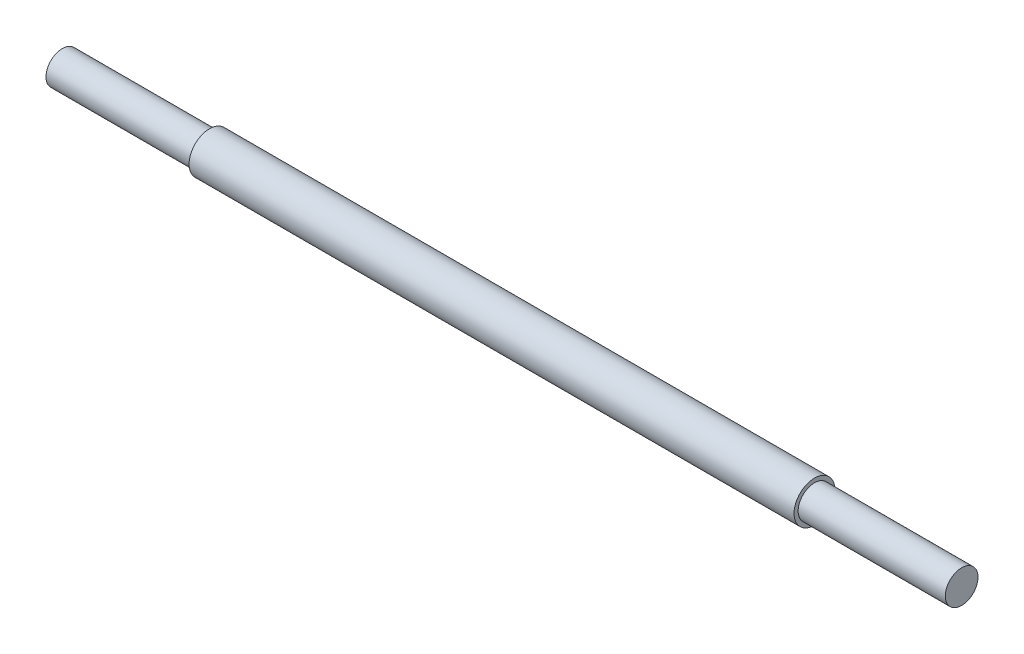
ISO-10303-21;
HEADER;
FILE_DESCRIPTION(('STEP AP214'),'2;1');
FILE_NAME('part.step','',(''),(''),'','','');
FILE_SCHEMA(('AUTOMOTIVE_DESIGN { 1 0 10303 214 1 1 1 1 }'));
ENDSEC;
DATA;
#1=APPLICATION_CONTEXT('core data for automotive mechanical design processes');
#2=APPLICATION_PROTOCOL_DEFINITION('international standard','automotive_design',2000,#1);
#3=PRODUCT_CONTEXT('',#1,'mechanical');
#4=PRODUCT('Part','Part','',(#3));
#5=PRODUCT_RELATED_PRODUCT_CATEGORY('part','',(#4));
#6=PRODUCT_DEFINITION_FORMATION('','',#4);
#7=PRODUCT_DEFINITION_CONTEXT('part definition',#1,'design');
#8=PRODUCT_DEFINITION('design','',#6,#7);
#9=PRODUCT_DEFINITION_SHAPE('','',#8);
#10=(LENGTH_UNIT() NAMED_UNIT(*) SI_UNIT(.MILLI.,.METRE.));
#11=(NAMED_UNIT(*) PLANE_ANGLE_UNIT() SI_UNIT($,.RADIAN.));
#12=(NAMED_UNIT(*) SI_UNIT($,.STERADIAN.) SOLID_ANGLE_UNIT());
#13=UNCERTAINTY_MEASURE_WITH_UNIT(LENGTH_MEASURE(1.E-05),#10,'distance_accuracy_value','');
#14=(GEOMETRIC_REPRESENTATION_CONTEXT(3) GLOBAL_UNCERTAINTY_ASSIGNED_CONTEXT((#13)) GLOBAL_UNIT_ASSIGNED_CONTEXT((#10,
#11,#12)) REPRESENTATION_CONTEXT('',''));
#15=CARTESIAN_POINT('',(0.,0.,0.));
#16=DIRECTION('',(0.,0.,1.));
#17=DIRECTION('',(1.,0.,0.));
#18=AXIS2_PLACEMENT_3D('',#15,#16,#17);
#19=CARTESIAN_POINT('',(45.,0.,0.));
#20=DIRECTION('',(-1.,0.,0.));
#21=DIRECTION('',(0.,0.,1.));
#22=AXIS2_PLACEMENT_3D('',#19,#20,#21);
#23=CYLINDRICAL_SURFACE('',#22,2.5);
#24=CARTESIAN_POINT('',(37.,0.,0.));
#25=DIRECTION('',(1.,0.,0.));
#26=DIRECTION('',(0.,0.,-1.));
#27=AXIS2_PLACEMENT_3D('',#24,#25,#26);
#28=CIRCLE('',#27,2.5);
#29=CARTESIAN_POINT('',(37.,0.,-2.5));
#30=VERTEX_POINT('',#29);
#31=EDGE_CURVE('E10',#30,#30,#28,.T.);
#32=ORIENTED_EDGE('',*,*,#31,.F.);
#33=EDGE_LOOP('',(#32));
#34=FACE_BOUND('',#33,.T.);
#35=CARTESIAN_POINT('',(-37.,0.,0.));
#36=DIRECTION('',(-1.,0.,0.));
#37=DIRECTION('',(0.,0.,1.));
#38=AXIS2_PLACEMENT_3D('',#35,#36,#37);
#39=CIRCLE('',#38,2.5);
#40=CARTESIAN_POINT('',(-37.,0.,2.5));
#41=VERTEX_POINT('',#40);
#42=EDGE_CURVE('E51',#41,#41,#39,.T.);
#43=ORIENTED_EDGE('',*,*,#42,.F.);
#44=EDGE_LOOP('',(#43));
#45=FACE_BOUND('',#44,.T.);
#46=ADVANCED_FACE('F41',(#34,#45),#23,.T.);
#47=CARTESIAN_POINT('',(37.,0.,0.));
#48=DIRECTION('',(1.,0.,0.));
#49=DIRECTION('',(0.,0.,-1.));
#50=AXIS2_PLACEMENT_3D('',#47,#48,#49);
#51=PLANE('',#50);
#52=CARTESIAN_POINT('',(37.,0.,0.));
#53=DIRECTION('',(1.,0.,0.));
#54=DIRECTION('',(0.,0.,-1.));
#55=AXIS2_PLACEMENT_3D('',#52,#53,#54);
#56=CIRCLE('',#55,2.);
#57=CARTESIAN_POINT('',(37.,0.,-2.));
#58=VERTEX_POINT('',#57);
#59=EDGE_CURVE('E47',#58,#58,#56,.T.);
#60=ORIENTED_EDGE('',*,*,#59,.F.);
#61=EDGE_LOOP('',(#60));
#62=FACE_BOUND('',#61,.T.);
#63=ORIENTED_EDGE('',*,*,#31,.T.);
#64=EDGE_LOOP('',(#63));
#65=FACE_BOUND('',#64,.T.);
#66=ADVANCED_FACE('F85',(#62,#65),#51,.T.);
#67=CARTESIAN_POINT('',(37.,0.,0.));
#68=DIRECTION('',(1.,0.,0.));
#69=DIRECTION('',(0.,0.,-1.));
#70=AXIS2_PLACEMENT_3D('',#67,#68,#69);
#71=CYLINDRICAL_SURFACE('',#70,2.);
#72=ORIENTED_EDGE('',*,*,#59,.T.);
#73=EDGE_LOOP('',(#72));
#74=FACE_BOUND('',#73,.T.);
#75=CARTESIAN_POINT('',(55.,0.,0.));
#76=DIRECTION('',(1.,0.,0.));
#77=DIRECTION('',(0.,0.,-1.));
#78=AXIS2_PLACEMENT_3D('',#75,#76,#77);
#79=CIRCLE('',#78,2.);
#80=CARTESIAN_POINT('',(55.,0.,-2.));
#81=VERTEX_POINT('',#80);
#82=EDGE_CURVE('E60',#81,#81,#79,.T.);
#83=ORIENTED_EDGE('',*,*,#82,.F.);
#84=EDGE_LOOP('',(#83));
#85=FACE_BOUND('',#84,.T.);
#86=ADVANCED_FACE('F81',(#74,#85),#71,.T.);
#87=CARTESIAN_POINT('',(-37.,0.,0.));
#88=DIRECTION('',(-1.,0.,0.));
#89=DIRECTION('',(0.,0.,1.));
#90=AXIS2_PLACEMENT_3D('',#87,#88,#89);
#91=PLANE('',#90);
#92=CARTESIAN_POINT('',(-37.,0.,0.));
#93=DIRECTION('',(-1.,0.,0.));
#94=DIRECTION('',(0.,0.,1.));
#95=AXIS2_PLACEMENT_3D('',#92,#93,#94);
#96=CIRCLE('',#95,2.);
#97=CARTESIAN_POINT('',(-37.,0.,2.));
#98=VERTEX_POINT('',#97);
#99=EDGE_CURVE('E55',#98,#98,#96,.T.);
#100=ORIENTED_EDGE('',*,*,#99,.F.);
#101=EDGE_LOOP('',(#100));
#102=FACE_BOUND('',#101,.T.);
#103=ORIENTED_EDGE('',*,*,#42,.T.);
#104=EDGE_LOOP('',(#103));
#105=FACE_BOUND('',#104,.T.);
#106=ADVANCED_FACE('F72',(#102,#105),#91,.T.);
#107=CARTESIAN_POINT('',(-37.,0.,0.));
#108=DIRECTION('',(-1.,0.,0.));
#109=DIRECTION('',(0.,0.,1.));
#110=AXIS2_PLACEMENT_3D('',#107,#108,#109);
#111=CYLINDRICAL_SURFACE('',#110,2.);
#112=ORIENTED_EDGE('',*,*,#99,.T.);
#113=EDGE_LOOP('',(#112));
#114=FACE_BOUND('',#113,.T.);
#115=CARTESIAN_POINT('',(-55.,0.,0.));
#116=DIRECTION('',(-1.,0.,0.));
#117=DIRECTION('',(0.,0.,1.));
#118=AXIS2_PLACEMENT_3D('',#115,#116,#117);
#119=CIRCLE('',#118,2.);
#120=CARTESIAN_POINT('',(-55.,0.,2.));
#121=VERTEX_POINT('',#120);
#122=EDGE_CURVE('E63',#121,#121,#119,.T.);
#123=ORIENTED_EDGE('',*,*,#122,.F.);
#124=EDGE_LOOP('',(#123));
#125=FACE_BOUND('',#124,.T.);
#126=ADVANCED_FACE('F69',(#114,#125),#111,.T.);
#127=CARTESIAN_POINT('',(55.,0.,0.));
#128=DIRECTION('',(1.,0.,0.));
#129=DIRECTION('',(0.,0.,-1.));
#130=AXIS2_PLACEMENT_3D('',#127,#128,#129);
#131=PLANE('',#130);
#132=ORIENTED_EDGE('',*,*,#82,.T.);
#133=EDGE_LOOP('',(#132));
#134=FACE_BOUND('',#133,.T.);
#135=ADVANCED_FACE('F71',(#134),#131,.T.);
#136=CARTESIAN_POINT('',(-55.,0.,0.));
#137=DIRECTION('',(-1.,0.,0.));
#138=DIRECTION('',(0.,0.,1.));
#139=AXIS2_PLACEMENT_3D('',#136,#137,#138);
#140=PLANE('',#139);
#141=ORIENTED_EDGE('',*,*,#122,.T.);
#142=EDGE_LOOP('',(#141));
#143=FACE_BOUND('',#142,.T.);
#144=ADVANCED_FACE('F67',(#143),#140,.T.);
#145=CLOSED_SHELL('',(#46,#66,#86,#106,#126,#135,#144));
#146=MANIFOLD_SOLID_BREP('B2',#145);
#147=ADVANCED_BREP_SHAPE_REPRESENTATION('',(#18,#146),#14);
#148=SHAPE_DEFINITION_REPRESENTATION(#9,#147);
ENDSEC;
END-ISO-10303-21;
